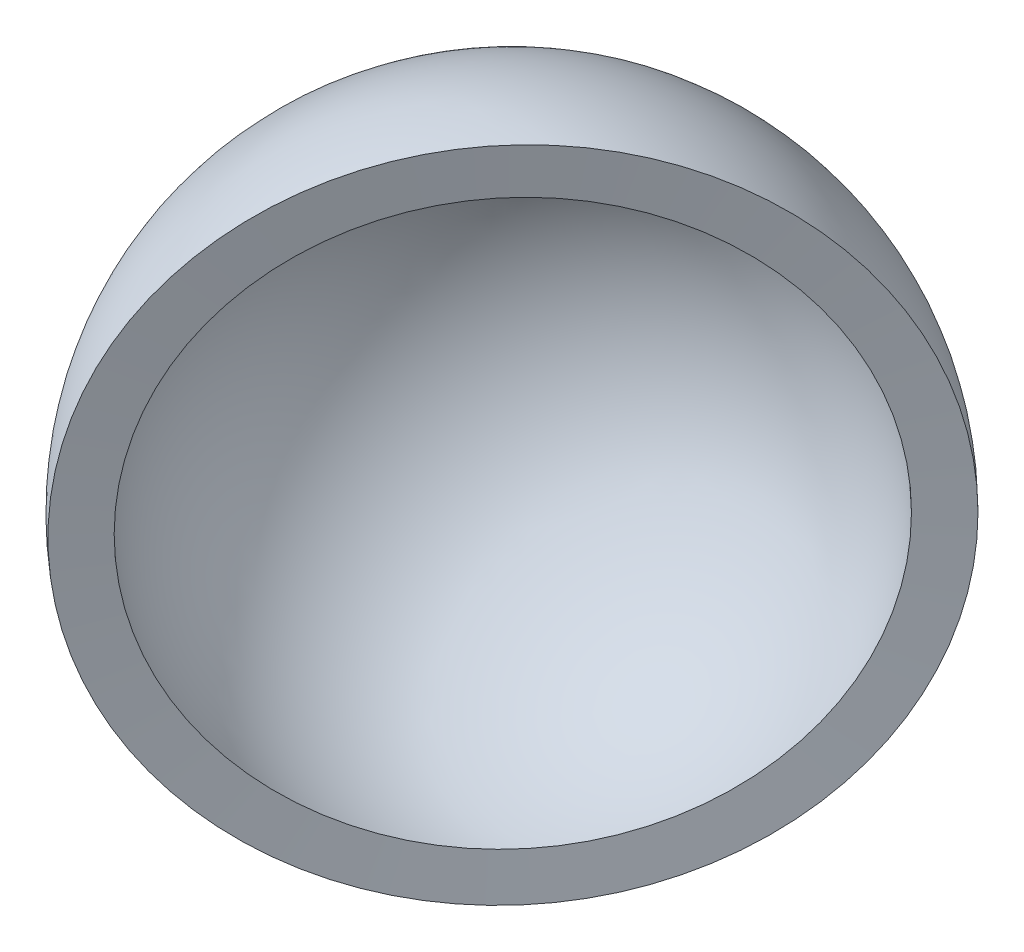
ISO-10303-21;
HEADER;
FILE_DESCRIPTION(('STEP AP214'),'2;1');
FILE_NAME('part.step','',(''),(''),'','','');
FILE_SCHEMA(('AUTOMOTIVE_DESIGN { 1 0 10303 214 1 1 1 1 }'));
ENDSEC;
DATA;
#1=APPLICATION_CONTEXT('core data for automotive mechanical design processes');
#2=APPLICATION_PROTOCOL_DEFINITION('international standard','automotive_design',2000,#1);
#3=PRODUCT_CONTEXT('',#1,'mechanical');
#4=PRODUCT('Part','Part','',(#3));
#5=PRODUCT_RELATED_PRODUCT_CATEGORY('part','',(#4));
#6=PRODUCT_DEFINITION_FORMATION('','',#4);
#7=PRODUCT_DEFINITION_CONTEXT('part definition',#1,'design');
#8=PRODUCT_DEFINITION('design','',#6,#7);
#9=PRODUCT_DEFINITION_SHAPE('','',#8);
#10=(LENGTH_UNIT() NAMED_UNIT(*) SI_UNIT(.MILLI.,.METRE.));
#11=(NAMED_UNIT(*) PLANE_ANGLE_UNIT() SI_UNIT($,.RADIAN.));
#12=(NAMED_UNIT(*) SI_UNIT($,.STERADIAN.) SOLID_ANGLE_UNIT());
#13=UNCERTAINTY_MEASURE_WITH_UNIT(LENGTH_MEASURE(1.E-05),#10,'distance_accuracy_value','');
#14=(GEOMETRIC_REPRESENTATION_CONTEXT(3) GLOBAL_UNCERTAINTY_ASSIGNED_CONTEXT((#13)) GLOBAL_UNIT_ASSIGNED_CONTEXT((#10,
#11,#12)) REPRESENTATION_CONTEXT('',''));
#15=CARTESIAN_POINT('',(0.,0.,0.));
#16=DIRECTION('',(0.,0.,1.));
#17=DIRECTION('',(1.,0.,0.));
#18=AXIS2_PLACEMENT_3D('',#15,#16,#17);
#19=CARTESIAN_POINT('',(0.,0.,0.));
#20=DIRECTION('',(0.739665383739434,0.,0.672974828725114));
#21=DIRECTION('',(-0.672974828725114,0.,0.739665383739434));
#22=AXIS2_PLACEMENT_3D('',#19,#20,#21);
#23=SPHERICAL_SURFACE('',#22,10.);
#24=CARTESIAN_POINT('',(0.348806547178675,0.,0.317357052940683));
#25=DIRECTION('',(0.739665383739434,0.,0.672974828725114));
#26=DIRECTION('',(0.672974828725114,0.,-0.739665383739434));
#27=AXIS2_PLACEMENT_3D('',#24,#25,#26);
#28=CIRCLE('',#27,9.98887473610489);
#29=CARTESIAN_POINT('',(7.07106781186548,0.,-7.07106781186548));
#30=VERTEX_POINT('',#29);
#31=EDGE_CURVE('E11',#30,#30,#28,.T.);
#32=ORIENTED_EDGE('',*,*,#31,.T.);
#33=EDGE_LOOP('',(#32));
#34=FACE_BOUND('',#33,.T.);
#35=ADVANCED_FACE('F33',(#34),#23,.F.);
#36=CARTESIAN_POINT('',(0.348806547178675,0.,0.317357052940683));
#37=DIRECTION('',(0.739665383739434,0.,0.672974828725114));
#38=DIRECTION('',(0.672974828725114,0.,-0.739665383739434));
#39=AXIS2_PLACEMENT_3D('',#36,#37,#38);
#40=CONICAL_SURFACE('',#39,9.98887473610488,1.52362148738738);
#41=CARTESIAN_POINT('',(0.40689498571814,0.,0.370208055348519));
#42=DIRECTION('',(0.739665383739434,0.,0.672974828725114));
#43=DIRECTION('',(0.672974828725114,0.,-0.739665383739434));
#44=AXIS2_PLACEMENT_3D('',#41,#42,#43);
#45=CIRCLE('',#44,11.652370277917);
#46=CARTESIAN_POINT('',(8.24864687774095,0.,-8.24864687774095));
#47=VERTEX_POINT('',#46);
#48=EDGE_CURVE('E39',#47,#47,#45,.T.);
#49=ORIENTED_EDGE('',*,*,#48,.T.);
#50=EDGE_LOOP('',(#49));
#51=FACE_BOUND('',#50,.T.);
#52=ORIENTED_EDGE('',*,*,#31,.F.);
#53=EDGE_LOOP('',(#52));
#54=FACE_BOUND('',#53,.T.);
#55=ADVANCED_FACE('F61',(#51,#54),#40,.F.);
#56=CARTESIAN_POINT('',(0.,0.,0.));
#57=DIRECTION('',(0.739665383739434,0.,0.672974828725114));
#58=DIRECTION('',(0.672974828725114,0.,-0.739665383739434));
#59=AXIS2_PLACEMENT_3D('',#56,#57,#58);
#60=SPHERICAL_SURFACE('',#59,11.6653482857277);
#61=CARTESIAN_POINT('',(-8.62052843430562,0.,-7.84327450511118));
#62=DIRECTION('',(0.739665383739434,0.,0.672974828725114));
#63=DIRECTION('',(0.672974828725114,0.,-0.739665383739434));
#64=AXIS2_PLACEMENT_3D('',#61,#62,#63);
#65=CIRCLE('',#64,0.499885164945334);
#66=CARTESIAN_POINT('',(-8.28411830104431,0.,-8.21302225746612));
#67=VERTEX_POINT('',#66);
#68=EDGE_CURVE('E54',#67,#67,#65,.T.);
#69=ORIENTED_EDGE('',*,*,#68,.T.);
#70=EDGE_LOOP('',(#69));
#71=FACE_BOUND('',#70,.T.);
#72=ORIENTED_EDGE('',*,*,#48,.F.);
#73=EDGE_LOOP('',(#72));
#74=FACE_BOUND('',#73,.T.);
#75=ADVANCED_FACE('F64',(#71,#74),#60,.T.);
#76=CARTESIAN_POINT('',(-8.62052843430562,0.,-7.84327450511118));
#77=DIRECTION('',(-0.739665383739434,0.,-0.672974828725114));
#78=DIRECTION('',(-0.672974828725114,0.,0.739665383739434));
#79=AXIS2_PLACEMENT_3D('',#76,#77,#78);
#80=CONICAL_SURFACE('',#79,0.499885164945335,0.0214326340535485);
#81=CARTESIAN_POINT('',(-8.6231424830634,0.,-7.84565286301966));
#82=DIRECTION('',(0.739665383739434,0.,0.672974828725114));
#83=DIRECTION('',(0.672974828725114,0.,-0.739665383739434));
#84=AXIS2_PLACEMENT_3D('',#81,#82,#83);
#85=CIRCLE('',#84,0.499960921539985);
#86=CARTESIAN_POINT('',(-8.28668136752078,0.,-8.21545664990526));
#87=VERTEX_POINT('',#86);
#88=EDGE_CURVE('E51',#87,#87,#85,.T.);
#89=ORIENTED_EDGE('',*,*,#88,.T.);
#90=EDGE_LOOP('',(#89));
#91=FACE_BOUND('',#90,.T.);
#92=ORIENTED_EDGE('',*,*,#68,.F.);
#93=EDGE_LOOP('',(#92));
#94=FACE_BOUND('',#93,.T.);
#95=ADVANCED_FACE('F66',(#91,#94),#80,.T.);
#96=CARTESIAN_POINT('',(-8.6231424830634,0.,-7.84565286301966));
#97=DIRECTION('',(0.739665383739434,0.,0.672974828725114));
#98=DIRECTION('',(0.672974828725114,0.,-0.739665383739434));
#99=AXIS2_PLACEMENT_3D('',#96,#97,#98);
#100=CONICAL_SURFACE('',#99,0.499960921539985,1.54936369273955);
#101=CARTESIAN_POINT('',(-8.63106836497481,0.,-7.85286412251495));
#102=DIRECTION('',(0.739665383739434,0.,0.672974828725114));
#103=DIRECTION('',(0.672974828725114,0.,-0.739665383739434));
#104=AXIS2_PLACEMENT_3D('',#101,#102,#103);
#105=CIRCLE('',#104,7.57565946585487E-05);
#106=CARTESIAN_POINT('',(-8.6310173826935,0.,-7.85292015704561));
#107=VERTEX_POINT('',#106);
#108=EDGE_CURVE('E49',#107,#107,#105,.T.);
#109=ORIENTED_EDGE('',*,*,#108,.T.);
#110=EDGE_LOOP('',(#109));
#111=FACE_BOUND('',#110,.T.);
#112=ORIENTED_EDGE('',*,*,#88,.F.);
#113=EDGE_LOOP('',(#112));
#114=FACE_BOUND('',#113,.T.);
#115=ADVANCED_FACE('F45',(#111,#114),#100,.T.);
#116=CARTESIAN_POINT('',(-8.63106836497481,0.,-7.85286412251495));
#117=DIRECTION('',(-0.739665383739434,0.,-0.672974828725114));
#118=DIRECTION('',(-0.672974828725114,0.,0.739665383739434));
#119=AXIS2_PLACEMENT_3D('',#116,#117,#118);
#120=CONICAL_SURFACE('',#119,7.57565946576958E-05,0.021432634055139);
#121=CARTESIAN_POINT('',(-8.62845431621697,0.,-7.85048576460641));
#122=VERTEX_POINT('',#121);
#123=VERTEX_LOOP('',#122);
#124=FACE_BOUND('',#123,.T.);
#125=ORIENTED_EDGE('',*,*,#108,.F.);
#126=EDGE_LOOP('',(#125));
#127=FACE_BOUND('',#126,.T.);
#128=ADVANCED_FACE('F42',(#124,#127),#120,.F.);
#129=CLOSED_SHELL('',(#35,#55,#75,#95,#115,#128));
#130=MANIFOLD_SOLID_BREP('B2',#129);
#131=ADVANCED_BREP_SHAPE_REPRESENTATION('',(#18,#130),#14);
#132=SHAPE_DEFINITION_REPRESENTATION(#9,#131);
ENDSEC;
END-ISO-10303-21;
